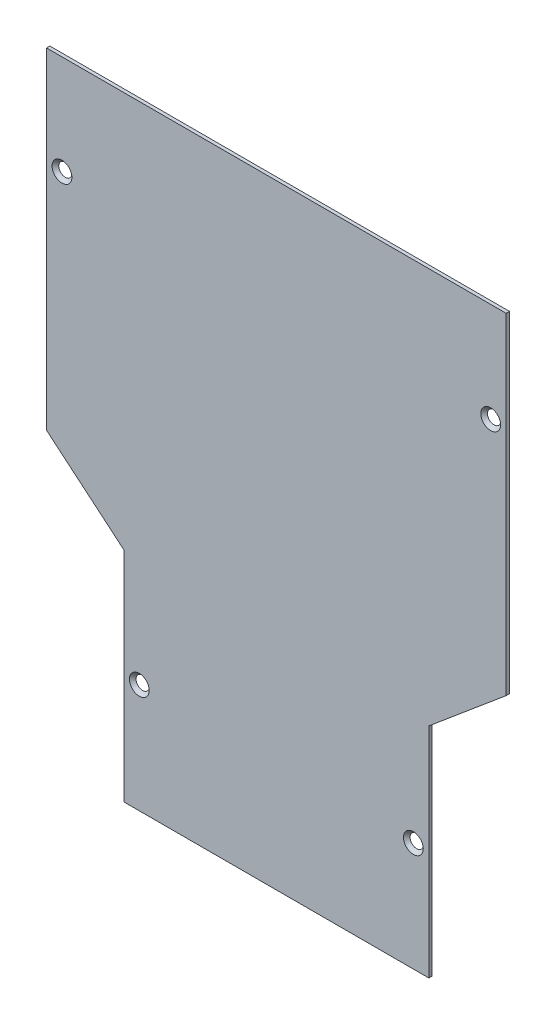
ISO-10303-21;
HEADER;
FILE_DESCRIPTION(('STEP AP214'),'2;1');
FILE_NAME('part.step','',(''),(''),'','','');
FILE_SCHEMA(('AUTOMOTIVE_DESIGN { 1 0 10303 214 1 1 1 1 }'));
ENDSEC;
DATA;
#1=APPLICATION_CONTEXT('core data for automotive mechanical design processes');
#2=APPLICATION_PROTOCOL_DEFINITION('international standard','automotive_design',2000,#1);
#3=PRODUCT_CONTEXT('',#1,'mechanical');
#4=PRODUCT('Part','Part','',(#3));
#5=PRODUCT_RELATED_PRODUCT_CATEGORY('part','',(#4));
#6=PRODUCT_DEFINITION_FORMATION('','',#4);
#7=PRODUCT_DEFINITION_CONTEXT('part definition',#1,'design');
#8=PRODUCT_DEFINITION('design','',#6,#7);
#9=PRODUCT_DEFINITION_SHAPE('','',#8);
#10=(LENGTH_UNIT() NAMED_UNIT(*) SI_UNIT(.MILLI.,.METRE.));
#11=(NAMED_UNIT(*) PLANE_ANGLE_UNIT() SI_UNIT($,.RADIAN.));
#12=(NAMED_UNIT(*) SI_UNIT($,.STERADIAN.) SOLID_ANGLE_UNIT());
#13=UNCERTAINTY_MEASURE_WITH_UNIT(LENGTH_MEASURE(1.E-05),#10,'distance_accuracy_value','');
#14=(GEOMETRIC_REPRESENTATION_CONTEXT(3) GLOBAL_UNCERTAINTY_ASSIGNED_CONTEXT((#13)) GLOBAL_UNIT_ASSIGNED_CONTEXT((#10,
#11,#12)) REPRESENTATION_CONTEXT('',''));
#15=CARTESIAN_POINT('',(0.,0.,0.));
#16=DIRECTION('',(0.,0.,1.));
#17=DIRECTION('',(1.,0.,0.));
#18=AXIS2_PLACEMENT_3D('',#15,#16,#17);
#19=CARTESIAN_POINT('',(0.,0.,0.));
#20=DIRECTION('',(0.,0.,1.));
#21=DIRECTION('',(1.,0.,0.));
#22=AXIS2_PLACEMENT_3D('',#19,#20,#21);
#23=PLANE('',#22);
#24=CARTESIAN_POINT('',(-100.139052355036,95.9966091245376,0.));
#25=DIRECTION('',(0.,0.,1.));
#26=DIRECTION('',(1.,0.,0.));
#27=AXIS2_PLACEMENT_3D('',#24,#25,#26);
#28=CIRCLE('',#27,2.98);
#29=CARTESIAN_POINT('',(-97.1590523550359,95.9966091245376,0.));
#30=VERTEX_POINT('',#29);
#31=EDGE_CURVE('E37',#30,#30,#28,.T.);
#32=ORIENTED_EDGE('',*,*,#31,.T.);
#33=EDGE_LOOP('',(#32));
#34=FACE_BOUND('',#33,.T.);
#35=CARTESIAN_POINT('',(93.8609476449641,95.9966091245376,0.));
#36=DIRECTION('',(0.,0.,1.));
#37=DIRECTION('',(1.,0.,0.));
#38=AXIS2_PLACEMENT_3D('',#35,#36,#37);
#39=CIRCLE('',#38,2.98);
#40=CARTESIAN_POINT('',(96.840947644964,95.9966091245376,0.));
#41=VERTEX_POINT('',#40);
#42=EDGE_CURVE('E161',#41,#41,#39,.T.);
#43=ORIENTED_EDGE('',*,*,#42,.T.);
#44=EDGE_LOOP('',(#43));
#45=FACE_BOUND('',#44,.T.);
#46=DIRECTION('',(0.,1.,0.));
#47=VECTOR('',#46,1.);
#48=CARTESIAN_POINT('',(65.860947644964,-38.2109300542074,0.));
#49=LINE('',#48,#47);
#50=CARTESIAN_POINT('',(65.860947644964,-137.003390875462,0.));
#51=VERTEX_POINT('',#50);
#52=CARTESIAN_POINT('',(65.860947644964,-38.2109300542074,0.));
#53=VERTEX_POINT('',#52);
#54=EDGE_CURVE('E132',#51,#53,#49,.T.);
#55=ORIENTED_EDGE('',*,*,#54,.F.);
#56=DIRECTION('',(1.,0.,0.));
#57=VECTOR('',#56,1.);
#58=CARTESIAN_POINT('',(-72.1390523550359,-137.003390875462,0.));
#59=LINE('',#58,#57);
#60=CARTESIAN_POINT('',(-72.1390523550359,-137.003390875462,0.));
#61=VERTEX_POINT('',#60);
#62=EDGE_CURVE('E87',#61,#51,#59,.T.);
#63=ORIENTED_EDGE('',*,*,#62,.F.);
#64=DIRECTION('',(0.,-1.,0.));
#65=VECTOR('',#64,1.);
#66=CARTESIAN_POINT('',(-72.1390523550359,-38.2109300542074,0.));
#67=LINE('',#66,#65);
#68=CARTESIAN_POINT('',(-72.1390523550359,-38.2109300542074,0.));
#69=VERTEX_POINT('',#68);
#70=EDGE_CURVE('E81',#69,#61,#67,.T.);
#71=ORIENTED_EDGE('',*,*,#70,.F.);
#72=DIRECTION('',(0.766044443118979,-0.642787609686538,0.));
#73=VECTOR('',#72,1.);
#74=CARTESIAN_POINT('',(-107.139052355036,-8.84244296300268,0.));
#75=LINE('',#74,#73);
#76=CARTESIAN_POINT('',(-107.139052355036,-8.84244296300268,0.));
#77=VERTEX_POINT('',#76);
#78=EDGE_CURVE('E122',#77,#69,#75,.T.);
#79=ORIENTED_EDGE('',*,*,#78,.F.);
#80=DIRECTION('',(0.,-1.,0.));
#81=VECTOR('',#80,1.);
#82=CARTESIAN_POINT('',(-107.139052355036,140.996609124538,0.));
#83=LINE('',#82,#81);
#84=CARTESIAN_POINT('',(-107.139052355036,140.996609124538,0.));
#85=VERTEX_POINT('',#84);
#86=EDGE_CURVE('E142',#85,#77,#83,.T.);
#87=ORIENTED_EDGE('',*,*,#86,.F.);
#88=DIRECTION('',(-1.,0.,0.));
#89=VECTOR('',#88,1.);
#90=CARTESIAN_POINT('',(100.860947644964,140.996609124538,0.));
#91=LINE('',#90,#89);
#92=CARTESIAN_POINT('',(100.860947644964,140.996609124538,0.));
#93=VERTEX_POINT('',#92);
#94=EDGE_CURVE('E140',#93,#85,#91,.T.);
#95=ORIENTED_EDGE('',*,*,#94,.F.);
#96=DIRECTION('',(0.,1.,0.));
#97=VECTOR('',#96,1.);
#98=CARTESIAN_POINT('',(100.860947644964,140.996609124538,0.));
#99=LINE('',#98,#97);
#100=CARTESIAN_POINT('',(100.860947644964,-8.84244296300268,0.));
#101=VERTEX_POINT('',#100);
#102=EDGE_CURVE('E138',#101,#93,#99,.T.);
#103=ORIENTED_EDGE('',*,*,#102,.F.);
#104=DIRECTION('',(0.766044443118979,0.642787609686538,0.));
#105=VECTOR('',#104,1.);
#106=CARTESIAN_POINT('',(100.860947644964,-8.84244296300268,0.));
#107=LINE('',#106,#105);
#108=EDGE_CURVE('E135',#53,#101,#107,.T.);
#109=ORIENTED_EDGE('',*,*,#108,.F.);
#110=EDGE_LOOP('',(#55,#63,#71,#79,#87,#95,#103,#109));
#111=FACE_BOUND('',#110,.T.);
#112=CARTESIAN_POINT('',(-65.1390523550359,-87.6071604648348,0.));
#113=DIRECTION('',(0.,0.,1.));
#114=DIRECTION('',(1.,0.,0.));
#115=AXIS2_PLACEMENT_3D('',#112,#113,#114);
#116=CIRCLE('',#115,2.98);
#117=CARTESIAN_POINT('',(-62.1590523550359,-87.6071604648348,0.));
#118=VERTEX_POINT('',#117);
#119=EDGE_CURVE('E136',#118,#118,#116,.T.);
#120=ORIENTED_EDGE('',*,*,#119,.T.);
#121=EDGE_LOOP('',(#120));
#122=FACE_BOUND('',#121,.T.);
#123=CARTESIAN_POINT('',(58.860947644964,-87.6071604648348,0.));
#124=DIRECTION('',(0.,0.,1.));
#125=DIRECTION('',(1.,0.,0.));
#126=AXIS2_PLACEMENT_3D('',#123,#124,#125);
#127=CIRCLE('',#126,2.98);
#128=CARTESIAN_POINT('',(61.840947644964,-87.6071604648348,0.));
#129=VERTEX_POINT('',#128);
#130=EDGE_CURVE('E168',#129,#129,#127,.T.);
#131=ORIENTED_EDGE('',*,*,#130,.T.);
#132=EDGE_LOOP('',(#131));
#133=FACE_BOUND('',#132,.T.);
#134=ADVANCED_FACE('F33',(#34,#45,#111,#122,#133),#23,.F.);
#135=CARTESIAN_POINT('',(65.860947644964,-38.2109300542074,1.5));
#136=DIRECTION('',(-1.,0.,0.));
#137=DIRECTION('',(0.,-1.,0.));
#138=AXIS2_PLACEMENT_3D('',#135,#136,#137);
#139=PLANE('',#138);
#140=ORIENTED_EDGE('',*,*,#54,.T.);
#141=DIRECTION('',(0.,0.,-1.));
#142=VECTOR('',#141,1.);
#143=CARTESIAN_POINT('',(65.860947644964,-38.2109300542074,1.5));
#144=LINE('',#143,#142);
#145=CARTESIAN_POINT('',(65.860947644964,-38.2109300542074,1.5));
#146=VERTEX_POINT('',#145);
#147=EDGE_CURVE('E11',#146,#53,#144,.T.);
#148=ORIENTED_EDGE('',*,*,#147,.F.);
#149=DIRECTION('',(0.,1.,0.));
#150=VECTOR('',#149,1.);
#151=CARTESIAN_POINT('',(65.860947644964,-38.2109300542074,1.5));
#152=LINE('',#151,#150);
#153=CARTESIAN_POINT('',(65.860947644964,-137.003390875462,1.5));
#154=VERTEX_POINT('',#153);
#155=EDGE_CURVE('E147',#154,#146,#152,.T.);
#156=ORIENTED_EDGE('',*,*,#155,.F.);
#157=DIRECTION('',(0.,0.,-1.));
#158=VECTOR('',#157,1.);
#159=CARTESIAN_POINT('',(65.860947644964,-137.003390875462,1.5));
#160=LINE('',#159,#158);
#161=EDGE_CURVE('E128',#154,#51,#160,.T.);
#162=ORIENTED_EDGE('',*,*,#161,.T.);
#163=EDGE_LOOP('',(#140,#148,#156,#162));
#164=FACE_BOUND('',#163,.T.);
#165=ADVANCED_FACE('F35',(#164),#139,.F.);
#166=CARTESIAN_POINT('',(100.860947644964,-8.84244296300268,1.5));
#167=DIRECTION('',(-0.642787609686538,0.766044443118979,0.));
#168=DIRECTION('',(-0.766044443118979,-0.642787609686538,0.));
#169=AXIS2_PLACEMENT_3D('',#166,#167,#168);
#170=PLANE('',#169);
#171=ORIENTED_EDGE('',*,*,#108,.T.);
#172=DIRECTION('',(0.,0.,-1.));
#173=VECTOR('',#172,1.);
#174=CARTESIAN_POINT('',(100.860947644964,-8.84244296300268,1.5));
#175=LINE('',#174,#173);
#176=CARTESIAN_POINT('',(100.860947644964,-8.84244296300268,1.5));
#177=VERTEX_POINT('',#176);
#178=EDGE_CURVE('E43',#177,#101,#175,.T.);
#179=ORIENTED_EDGE('',*,*,#178,.F.);
#180=DIRECTION('',(0.766044443118979,0.642787609686538,0.));
#181=VECTOR('',#180,1.);
#182=CARTESIAN_POINT('',(100.860947644964,-8.84244296300268,1.5));
#183=LINE('',#182,#181);
#184=EDGE_CURVE('E95',#146,#177,#183,.T.);
#185=ORIENTED_EDGE('',*,*,#184,.F.);
#186=ORIENTED_EDGE('',*,*,#147,.T.);
#187=EDGE_LOOP('',(#171,#179,#185,#186));
#188=FACE_BOUND('',#187,.T.);
#189=ADVANCED_FACE('F222',(#188),#170,.F.);
#190=CARTESIAN_POINT('',(100.860947644964,140.996609124538,1.5));
#191=DIRECTION('',(-1.,0.,0.));
#192=DIRECTION('',(0.,-1.,0.));
#193=AXIS2_PLACEMENT_3D('',#190,#191,#192);
#194=PLANE('',#193);
#195=ORIENTED_EDGE('',*,*,#102,.T.);
#196=DIRECTION('',(0.,0.,-1.));
#197=VECTOR('',#196,1.);
#198=CARTESIAN_POINT('',(100.860947644964,140.996609124538,1.5));
#199=LINE('',#198,#197);
#200=CARTESIAN_POINT('',(100.860947644964,140.996609124538,1.5));
#201=VERTEX_POINT('',#200);
#202=EDGE_CURVE('E154',#201,#93,#199,.T.);
#203=ORIENTED_EDGE('',*,*,#202,.F.);
#204=DIRECTION('',(0.,1.,0.));
#205=VECTOR('',#204,1.);
#206=CARTESIAN_POINT('',(100.860947644964,140.996609124538,1.5));
#207=LINE('',#206,#205);
#208=EDGE_CURVE('E184',#177,#201,#207,.T.);
#209=ORIENTED_EDGE('',*,*,#208,.F.);
#210=ORIENTED_EDGE('',*,*,#178,.T.);
#211=EDGE_LOOP('',(#195,#203,#209,#210));
#212=FACE_BOUND('',#211,.T.);
#213=ADVANCED_FACE('F305',(#212),#194,.F.);
#214=CARTESIAN_POINT('',(100.860947644964,140.996609124538,1.5));
#215=DIRECTION('',(0.,-1.,0.));
#216=DIRECTION('',(0.,0.,-1.));
#217=AXIS2_PLACEMENT_3D('',#214,#215,#216);
#218=PLANE('',#217);
#219=ORIENTED_EDGE('',*,*,#94,.T.);
#220=DIRECTION('',(0.,0.,-1.));
#221=VECTOR('',#220,1.);
#222=CARTESIAN_POINT('',(-107.139052355036,140.996609124538,1.5));
#223=LINE('',#222,#221);
#224=CARTESIAN_POINT('',(-107.139052355036,140.996609124538,1.5));
#225=VERTEX_POINT('',#224);
#226=EDGE_CURVE('E151',#225,#85,#223,.T.);
#227=ORIENTED_EDGE('',*,*,#226,.F.);
#228=DIRECTION('',(-1.,0.,0.));
#229=VECTOR('',#228,1.);
#230=CARTESIAN_POINT('',(100.860947644964,140.996609124538,1.5));
#231=LINE('',#230,#229);
#232=EDGE_CURVE('E186',#201,#225,#231,.T.);
#233=ORIENTED_EDGE('',*,*,#232,.F.);
#234=ORIENTED_EDGE('',*,*,#202,.T.);
#235=EDGE_LOOP('',(#219,#227,#233,#234));
#236=FACE_BOUND('',#235,.T.);
#237=ADVANCED_FACE('F192',(#236),#218,.F.);
#238=CARTESIAN_POINT('',(-107.139052355036,140.996609124538,1.5));
#239=DIRECTION('',(1.,0.,0.));
#240=DIRECTION('',(0.,1.,0.));
#241=AXIS2_PLACEMENT_3D('',#238,#239,#240);
#242=PLANE('',#241);
#243=ORIENTED_EDGE('',*,*,#86,.T.);
#244=DIRECTION('',(0.,0.,-1.));
#245=VECTOR('',#244,1.);
#246=CARTESIAN_POINT('',(-107.139052355036,-8.84244296300268,1.5));
#247=LINE('',#246,#245);
#248=CARTESIAN_POINT('',(-107.139052355036,-8.84244296300268,1.5));
#249=VERTEX_POINT('',#248);
#250=EDGE_CURVE('E123',#249,#77,#247,.T.);
#251=ORIENTED_EDGE('',*,*,#250,.F.);
#252=DIRECTION('',(0.,-1.,0.));
#253=VECTOR('',#252,1.);
#254=CARTESIAN_POINT('',(-107.139052355036,140.996609124538,1.5));
#255=LINE('',#254,#253);
#256=EDGE_CURVE('E114',#225,#249,#255,.T.);
#257=ORIENTED_EDGE('',*,*,#256,.F.);
#258=ORIENTED_EDGE('',*,*,#226,.T.);
#259=EDGE_LOOP('',(#243,#251,#257,#258));
#260=FACE_BOUND('',#259,.T.);
#261=ADVANCED_FACE('F196',(#260),#242,.F.);
#262=CARTESIAN_POINT('',(-107.139052355036,-8.84244296300268,1.5));
#263=DIRECTION('',(0.642787609686538,0.766044443118979,0.));
#264=DIRECTION('',(-0.766044443118979,0.642787609686538,0.));
#265=AXIS2_PLACEMENT_3D('',#262,#263,#264);
#266=PLANE('',#265);
#267=ORIENTED_EDGE('',*,*,#78,.T.);
#268=DIRECTION('',(0.,0.,-1.));
#269=VECTOR('',#268,1.);
#270=CARTESIAN_POINT('',(-72.1390523550359,-38.2109300542074,1.5));
#271=LINE('',#270,#269);
#272=CARTESIAN_POINT('',(-72.1390523550359,-38.2109300542074,1.5));
#273=VERTEX_POINT('',#272);
#274=EDGE_CURVE('E119',#273,#69,#271,.T.);
#275=ORIENTED_EDGE('',*,*,#274,.F.);
#276=DIRECTION('',(0.766044443118979,-0.642787609686538,0.));
#277=VECTOR('',#276,1.);
#278=CARTESIAN_POINT('',(-107.139052355036,-8.84244296300268,1.5));
#279=LINE('',#278,#277);
#280=EDGE_CURVE('E108',#249,#273,#279,.T.);
#281=ORIENTED_EDGE('',*,*,#280,.F.);
#282=ORIENTED_EDGE('',*,*,#250,.T.);
#283=EDGE_LOOP('',(#267,#275,#281,#282));
#284=FACE_BOUND('',#283,.T.);
#285=ADVANCED_FACE('F120',(#284),#266,.F.);
#286=CARTESIAN_POINT('',(-72.1390523550359,-38.2109300542074,1.5));
#287=DIRECTION('',(1.,0.,0.));
#288=DIRECTION('',(0.,1.,0.));
#289=AXIS2_PLACEMENT_3D('',#286,#287,#288);
#290=PLANE('',#289);
#291=ORIENTED_EDGE('',*,*,#70,.T.);
#292=DIRECTION('',(0.,0.,-1.));
#293=VECTOR('',#292,1.);
#294=CARTESIAN_POINT('',(-72.1390523550359,-137.003390875462,1.5));
#295=LINE('',#294,#293);
#296=CARTESIAN_POINT('',(-72.1390523550359,-137.003390875462,1.5));
#297=VERTEX_POINT('',#296);
#298=EDGE_CURVE('E124',#297,#61,#295,.T.);
#299=ORIENTED_EDGE('',*,*,#298,.F.);
#300=DIRECTION('',(0.,-1.,0.));
#301=VECTOR('',#300,1.);
#302=CARTESIAN_POINT('',(-72.1390523550359,-38.2109300542074,1.5));
#303=LINE('',#302,#301);
#304=EDGE_CURVE('E112',#273,#297,#303,.T.);
#305=ORIENTED_EDGE('',*,*,#304,.F.);
#306=ORIENTED_EDGE('',*,*,#274,.T.);
#307=EDGE_LOOP('',(#291,#299,#305,#306));
#308=FACE_BOUND('',#307,.T.);
#309=ADVANCED_FACE('F126',(#308),#290,.F.);
#310=CARTESIAN_POINT('',(-72.1390523550359,-137.003390875462,1.5));
#311=DIRECTION('',(0.,1.,0.));
#312=DIRECTION('',(0.,0.,1.));
#313=AXIS2_PLACEMENT_3D('',#310,#311,#312);
#314=PLANE('',#313);
#315=ORIENTED_EDGE('',*,*,#62,.T.);
#316=ORIENTED_EDGE('',*,*,#161,.F.);
#317=DIRECTION('',(1.,0.,0.));
#318=VECTOR('',#317,1.);
#319=CARTESIAN_POINT('',(-72.1390523550359,-137.003390875462,1.5));
#320=LINE('',#319,#318);
#321=EDGE_CURVE('E52',#297,#154,#320,.T.);
#322=ORIENTED_EDGE('',*,*,#321,.F.);
#323=ORIENTED_EDGE('',*,*,#298,.T.);
#324=EDGE_LOOP('',(#315,#316,#322,#323));
#325=FACE_BOUND('',#324,.T.);
#326=ADVANCED_FACE('F204',(#325),#314,.F.);
#327=CARTESIAN_POINT('',(0.,0.,1.5));
#328=DIRECTION('',(0.,0.,1.));
#329=DIRECTION('',(1.,0.,0.));
#330=AXIS2_PLACEMENT_3D('',#327,#328,#329);
#331=PLANE('',#330);
#332=CARTESIAN_POINT('',(-100.139052355036,95.9966091245376,1.5));
#333=DIRECTION('',(0.,0.,1.));
#334=DIRECTION('',(1.,0.,0.));
#335=AXIS2_PLACEMENT_3D('',#332,#333,#334);
#336=CIRCLE('',#335,4.48);
#337=CARTESIAN_POINT('',(-95.6590523550359,95.9966091245376,1.5));
#338=VERTEX_POINT('',#337);
#339=EDGE_CURVE('E175',#338,#338,#336,.T.);
#340=ORIENTED_EDGE('',*,*,#339,.F.);
#341=EDGE_LOOP('',(#340));
#342=FACE_BOUND('',#341,.T.);
#343=CARTESIAN_POINT('',(93.8609476449641,95.9966091245376,1.5));
#344=DIRECTION('',(0.,0.,1.));
#345=DIRECTION('',(1.,0.,0.));
#346=AXIS2_PLACEMENT_3D('',#343,#344,#345);
#347=CIRCLE('',#346,4.48);
#348=CARTESIAN_POINT('',(98.340947644964,95.9966091245376,1.5));
#349=VERTEX_POINT('',#348);
#350=EDGE_CURVE('E164',#349,#349,#347,.T.);
#351=ORIENTED_EDGE('',*,*,#350,.F.);
#352=EDGE_LOOP('',(#351));
#353=FACE_BOUND('',#352,.T.);
#354=CARTESIAN_POINT('',(58.860947644964,-87.6071604648348,1.5));
#355=DIRECTION('',(0.,0.,1.));
#356=DIRECTION('',(1.,0.,0.));
#357=AXIS2_PLACEMENT_3D('',#354,#355,#356);
#358=CIRCLE('',#357,4.48);
#359=CARTESIAN_POINT('',(63.340947644964,-87.6071604648348,1.5));
#360=VERTEX_POINT('',#359);
#361=EDGE_CURVE('E163',#360,#360,#358,.T.);
#362=ORIENTED_EDGE('',*,*,#361,.F.);
#363=EDGE_LOOP('',(#362));
#364=FACE_BOUND('',#363,.T.);
#365=CARTESIAN_POINT('',(-65.1390523550359,-87.6071604648348,1.5));
#366=DIRECTION('',(0.,0.,1.));
#367=DIRECTION('',(1.,0.,0.));
#368=AXIS2_PLACEMENT_3D('',#365,#366,#367);
#369=CIRCLE('',#368,4.48);
#370=CARTESIAN_POINT('',(-60.6590523550359,-87.6071604648348,1.5));
#371=VERTEX_POINT('',#370);
#372=EDGE_CURVE('E160',#371,#371,#369,.T.);
#373=ORIENTED_EDGE('',*,*,#372,.F.);
#374=EDGE_LOOP('',(#373));
#375=FACE_BOUND('',#374,.T.);
#376=ORIENTED_EDGE('',*,*,#155,.T.);
#377=ORIENTED_EDGE('',*,*,#184,.T.);
#378=ORIENTED_EDGE('',*,*,#208,.T.);
#379=ORIENTED_EDGE('',*,*,#232,.T.);
#380=ORIENTED_EDGE('',*,*,#256,.T.);
#381=ORIENTED_EDGE('',*,*,#280,.T.);
#382=ORIENTED_EDGE('',*,*,#304,.T.);
#383=ORIENTED_EDGE('',*,*,#321,.T.);
#384=EDGE_LOOP('',(#376,#377,#378,#379,#380,#381,#382,#383));
#385=FACE_BOUND('',#384,.T.);
#386=ADVANCED_FACE('F110',(#342,#353,#364,#375,#385),#331,.T.);
#387=CARTESIAN_POINT('',(-65.1390523550359,-87.6071604648348,1.5));
#388=DIRECTION('',(0.,0.,1.));
#389=DIRECTION('',(1.,0.,0.));
#390=AXIS2_PLACEMENT_3D('',#387,#388,#389);
#391=CONICAL_SURFACE('',#390,4.48,0.785398163397448);
#392=ORIENTED_EDGE('',*,*,#372,.T.);
#393=EDGE_LOOP('',(#392));
#394=FACE_BOUND('',#393,.T.);
#395=ORIENTED_EDGE('',*,*,#119,.F.);
#396=EDGE_LOOP('',(#395));
#397=FACE_BOUND('',#396,.T.);
#398=ADVANCED_FACE('F212',(#394,#397),#391,.F.);
#399=CARTESIAN_POINT('',(58.860947644964,-87.6071604648348,1.5));
#400=DIRECTION('',(0.,0.,1.));
#401=DIRECTION('',(1.,0.,0.));
#402=AXIS2_PLACEMENT_3D('',#399,#400,#401);
#403=CONICAL_SURFACE('',#402,4.48,0.785398163397448);
#404=ORIENTED_EDGE('',*,*,#361,.T.);
#405=EDGE_LOOP('',(#404));
#406=FACE_BOUND('',#405,.T.);
#407=ORIENTED_EDGE('',*,*,#130,.F.);
#408=EDGE_LOOP('',(#407));
#409=FACE_BOUND('',#408,.T.);
#410=ADVANCED_FACE('F226',(#406,#409),#403,.F.);
#411=CARTESIAN_POINT('',(93.8609476449641,95.9966091245376,1.5));
#412=DIRECTION('',(0.,0.,1.));
#413=DIRECTION('',(1.,0.,0.));
#414=AXIS2_PLACEMENT_3D('',#411,#412,#413);
#415=CONICAL_SURFACE('',#414,4.48,0.785398163397448);
#416=ORIENTED_EDGE('',*,*,#350,.T.);
#417=EDGE_LOOP('',(#416));
#418=FACE_BOUND('',#417,.T.);
#419=ORIENTED_EDGE('',*,*,#42,.F.);
#420=EDGE_LOOP('',(#419));
#421=FACE_BOUND('',#420,.T.);
#422=ADVANCED_FACE('F230',(#418,#421),#415,.F.);
#423=CARTESIAN_POINT('',(-100.139052355036,95.9966091245376,1.5));
#424=DIRECTION('',(0.,0.,1.));
#425=DIRECTION('',(1.,0.,0.));
#426=AXIS2_PLACEMENT_3D('',#423,#424,#425);
#427=CONICAL_SURFACE('',#426,4.48,0.785398163397448);
#428=ORIENTED_EDGE('',*,*,#339,.T.);
#429=EDGE_LOOP('',(#428));
#430=FACE_BOUND('',#429,.T.);
#431=ORIENTED_EDGE('',*,*,#31,.F.);
#432=EDGE_LOOP('',(#431));
#433=FACE_BOUND('',#432,.T.);
#434=ADVANCED_FACE('F234',(#430,#433),#427,.F.);
#435=CLOSED_SHELL('',(#134,#165,#189,#213,#237,#261,#285,#309,#326,#386,#398,#410,#422,#434));
#436=MANIFOLD_SOLID_BREP('B2',#435);
#437=ADVANCED_BREP_SHAPE_REPRESENTATION('',(#18,#436),#14);
#438=SHAPE_DEFINITION_REPRESENTATION(#9,#437);
ENDSEC;
END-ISO-10303-21;
